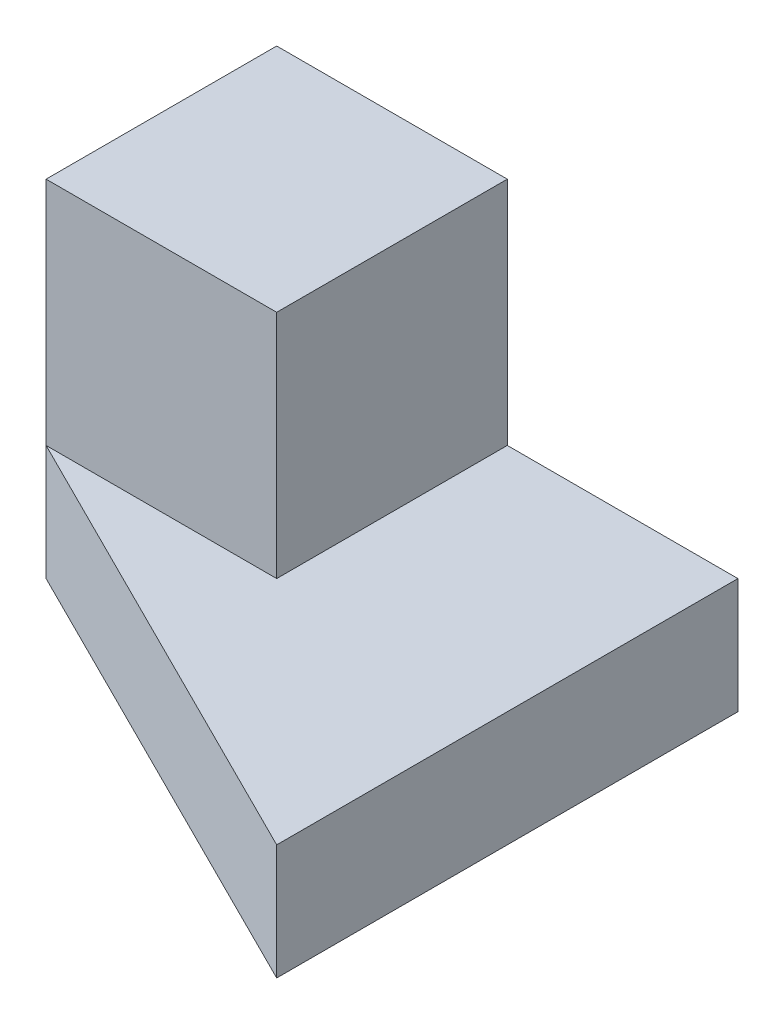
ISO-10303-21;
HEADER;
FILE_DESCRIPTION(('STEP AP214'),'2;1');
FILE_NAME('part.step','',(''),(''),'','','');
FILE_SCHEMA(('AUTOMOTIVE_DESIGN { 1 0 10303 214 1 1 1 1 }'));
ENDSEC;
DATA;
#1=APPLICATION_CONTEXT('core data for automotive mechanical design processes');
#2=APPLICATION_PROTOCOL_DEFINITION('international standard','automotive_design',2000,#1);
#3=PRODUCT_CONTEXT('',#1,'mechanical');
#4=PRODUCT('Part','Part','',(#3));
#5=PRODUCT_RELATED_PRODUCT_CATEGORY('part','',(#4));
#6=PRODUCT_DEFINITION_FORMATION('','',#4);
#7=PRODUCT_DEFINITION_CONTEXT('part definition',#1,'design');
#8=PRODUCT_DEFINITION('design','',#6,#7);
#9=PRODUCT_DEFINITION_SHAPE('','',#8);
#10=(LENGTH_UNIT() NAMED_UNIT(*) SI_UNIT(.MILLI.,.METRE.));
#11=(NAMED_UNIT(*) PLANE_ANGLE_UNIT() SI_UNIT($,.RADIAN.));
#12=(NAMED_UNIT(*) SI_UNIT($,.STERADIAN.) SOLID_ANGLE_UNIT());
#13=UNCERTAINTY_MEASURE_WITH_UNIT(LENGTH_MEASURE(1.E-05),#10,'distance_accuracy_value','');
#14=(GEOMETRIC_REPRESENTATION_CONTEXT(3) GLOBAL_UNCERTAINTY_ASSIGNED_CONTEXT((#13)) GLOBAL_UNIT_ASSIGNED_CONTEXT((#10,
#11,#12)) REPRESENTATION_CONTEXT('',''));
#15=CARTESIAN_POINT('',(0.,0.,0.));
#16=DIRECTION('',(0.,0.,1.));
#17=DIRECTION('',(1.,0.,0.));
#18=AXIS2_PLACEMENT_3D('',#15,#16,#17);
#19=CARTESIAN_POINT('',(0.,3.,0.));
#20=DIRECTION('',(0.,0.,1.));
#21=DIRECTION('',(1.,0.,0.));
#22=AXIS2_PLACEMENT_3D('',#19,#20,#21);
#23=PLANE('',#22);
#24=DIRECTION('',(-1.,0.,0.));
#25=VECTOR('',#24,1.);
#26=CARTESIAN_POINT('',(0.,1.,0.));
#27=LINE('',#26,#25);
#28=CARTESIAN_POINT('',(2.,1.,0.));
#29=VERTEX_POINT('',#28);
#30=CARTESIAN_POINT('',(0.,1.,0.));
#31=VERTEX_POINT('',#30);
#32=EDGE_CURVE('E124',#29,#31,#27,.T.);
#33=ORIENTED_EDGE('',*,*,#32,.F.);
#34=DIRECTION('',(0.,-1.,0.));
#35=VECTOR('',#34,1.);
#36=CARTESIAN_POINT('',(2.,3.,0.));
#37=LINE('',#36,#35);
#38=CARTESIAN_POINT('',(2.,3.,0.));
#39=VERTEX_POINT('',#38);
#40=EDGE_CURVE('E11',#39,#29,#37,.T.);
#41=ORIENTED_EDGE('',*,*,#40,.F.);
#42=DIRECTION('',(-1.,0.,0.));
#43=VECTOR('',#42,1.);
#44=CARTESIAN_POINT('',(0.,3.,0.));
#45=LINE('',#44,#43);
#46=CARTESIAN_POINT('',(0.,3.,0.));
#47=VERTEX_POINT('',#46);
#48=EDGE_CURVE('E105',#39,#47,#45,.T.);
#49=ORIENTED_EDGE('',*,*,#48,.T.);
#50=DIRECTION('',(0.,-1.,0.));
#51=VECTOR('',#50,1.);
#52=CARTESIAN_POINT('',(0.,3.,0.));
#53=LINE('',#52,#51);
#54=EDGE_CURVE('E53',#47,#31,#53,.T.);
#55=ORIENTED_EDGE('',*,*,#54,.T.);
#56=EDGE_LOOP('',(#33,#41,#49,#55));
#57=FACE_BOUND('',#56,.T.);
#58=ADVANCED_FACE('F37',(#57),#23,.T.);
#59=CARTESIAN_POINT('',(2.,3.,0.));
#60=DIRECTION('',(1.,0.,0.));
#61=DIRECTION('',(0.,0.,-1.));
#62=AXIS2_PLACEMENT_3D('',#59,#60,#61);
#63=PLANE('',#62);
#64=DIRECTION('',(0.,0.,1.));
#65=VECTOR('',#64,1.);
#66=CARTESIAN_POINT('',(2.,1.,0.));
#67=LINE('',#66,#65);
#68=CARTESIAN_POINT('',(2.,1.,-2.));
#69=VERTEX_POINT('',#68);
#70=EDGE_CURVE('E96',#69,#29,#67,.T.);
#71=ORIENTED_EDGE('',*,*,#70,.F.);
#72=DIRECTION('',(0.,-1.,0.));
#73=VECTOR('',#72,1.);
#74=CARTESIAN_POINT('',(2.,3.,-2.));
#75=LINE('',#74,#73);
#76=CARTESIAN_POINT('',(2.,3.,-2.));
#77=VERTEX_POINT('',#76);
#78=EDGE_CURVE('E45',#77,#69,#75,.T.);
#79=ORIENTED_EDGE('',*,*,#78,.F.);
#80=DIRECTION('',(0.,0.,1.));
#81=VECTOR('',#80,1.);
#82=CARTESIAN_POINT('',(2.,3.,0.));
#83=LINE('',#82,#81);
#84=EDGE_CURVE('E95',#77,#39,#83,.T.);
#85=ORIENTED_EDGE('',*,*,#84,.T.);
#86=ORIENTED_EDGE('',*,*,#40,.T.);
#87=EDGE_LOOP('',(#71,#79,#85,#86));
#88=FACE_BOUND('',#87,.T.);
#89=ADVANCED_FACE('F94',(#88),#63,.T.);
#90=CARTESIAN_POINT('',(0.,3.,-2.));
#91=DIRECTION('',(0.,0.,-1.));
#92=DIRECTION('',(-1.,0.,0.));
#93=AXIS2_PLACEMENT_3D('',#90,#91,#92);
#94=PLANE('',#93);
#95=DIRECTION('',(1.,0.,0.));
#96=VECTOR('',#95,1.);
#97=CARTESIAN_POINT('',(0.,0.,-2.));
#98=LINE('',#97,#96);
#99=CARTESIAN_POINT('',(0.,0.,-2.));
#100=VERTEX_POINT('',#99);
#101=CARTESIAN_POINT('',(4.,0.,-2.));
#102=VERTEX_POINT('',#101);
#103=EDGE_CURVE('E113',#100,#102,#98,.T.);
#104=ORIENTED_EDGE('',*,*,#103,.F.);
#105=DIRECTION('',(0.,-1.,0.));
#106=VECTOR('',#105,1.);
#107=CARTESIAN_POINT('',(0.,3.,-2.));
#108=LINE('',#107,#106);
#109=CARTESIAN_POINT('',(0.,3.,-2.));
#110=VERTEX_POINT('',#109);
#111=EDGE_CURVE('E63',#110,#100,#108,.T.);
#112=ORIENTED_EDGE('',*,*,#111,.F.);
#113=DIRECTION('',(1.,0.,0.));
#114=VECTOR('',#113,1.);
#115=CARTESIAN_POINT('',(0.,3.,-2.));
#116=LINE('',#115,#114);
#117=EDGE_CURVE('E104',#110,#77,#116,.T.);
#118=ORIENTED_EDGE('',*,*,#117,.T.);
#119=ORIENTED_EDGE('',*,*,#78,.T.);
#120=DIRECTION('',(1.,0.,0.));
#121=VECTOR('',#120,1.);
#122=CARTESIAN_POINT('',(0.,1.,-2.));
#123=LINE('',#122,#121);
#124=CARTESIAN_POINT('',(4.,1.,-2.));
#125=VERTEX_POINT('',#124);
#126=EDGE_CURVE('E74',#69,#125,#123,.T.);
#127=ORIENTED_EDGE('',*,*,#126,.T.);
#128=DIRECTION('',(0.,-1.,0.));
#129=VECTOR('',#128,1.);
#130=CARTESIAN_POINT('',(4.,1.,-2.));
#131=LINE('',#130,#129);
#132=EDGE_CURVE('E144',#125,#102,#131,.T.);
#133=ORIENTED_EDGE('',*,*,#132,.T.);
#134=EDGE_LOOP('',(#104,#112,#118,#119,#127,#133));
#135=FACE_BOUND('',#134,.T.);
#136=ADVANCED_FACE('F107',(#135),#94,.T.);
#137=CARTESIAN_POINT('',(0.,3.,0.));
#138=DIRECTION('',(-1.,0.,0.));
#139=DIRECTION('',(0.,0.,1.));
#140=AXIS2_PLACEMENT_3D('',#137,#138,#139);
#141=PLANE('',#140);
#142=DIRECTION('',(0.,0.,-1.));
#143=VECTOR('',#142,1.);
#144=CARTESIAN_POINT('',(0.,0.,0.));
#145=LINE('',#144,#143);
#146=CARTESIAN_POINT('',(0.,0.,0.));
#147=VERTEX_POINT('',#146);
#148=EDGE_CURVE('E115',#147,#100,#145,.T.);
#149=ORIENTED_EDGE('',*,*,#148,.F.);
#150=DIRECTION('',(0.,-1.,0.));
#151=VECTOR('',#150,1.);
#152=CARTESIAN_POINT('',(0.,1.,0.));
#153=LINE('',#152,#151);
#154=EDGE_CURVE('E116',#31,#147,#153,.T.);
#155=ORIENTED_EDGE('',*,*,#154,.F.);
#156=ORIENTED_EDGE('',*,*,#54,.F.);
#157=DIRECTION('',(0.,0.,-1.));
#158=VECTOR('',#157,1.);
#159=CARTESIAN_POINT('',(0.,3.,0.));
#160=LINE('',#159,#158);
#161=EDGE_CURVE('E108',#47,#110,#160,.T.);
#162=ORIENTED_EDGE('',*,*,#161,.T.);
#163=ORIENTED_EDGE('',*,*,#111,.T.);
#164=EDGE_LOOP('',(#149,#155,#156,#162,#163));
#165=FACE_BOUND('',#164,.T.);
#166=ADVANCED_FACE('F154',(#165),#141,.T.);
#167=CARTESIAN_POINT('',(0.,3.,0.));
#168=DIRECTION('',(0.,1.,0.));
#169=DIRECTION('',(0.,0.,1.));
#170=AXIS2_PLACEMENT_3D('',#167,#168,#169);
#171=PLANE('',#170);
#172=ORIENTED_EDGE('',*,*,#48,.F.);
#173=ORIENTED_EDGE('',*,*,#84,.F.);
#174=ORIENTED_EDGE('',*,*,#117,.F.);
#175=ORIENTED_EDGE('',*,*,#161,.F.);
#176=EDGE_LOOP('',(#172,#173,#174,#175));
#177=FACE_BOUND('',#176,.T.);
#178=ADVANCED_FACE('F102',(#177),#171,.T.);
#179=CARTESIAN_POINT('',(0.,0.,0.));
#180=DIRECTION('',(0.,1.,0.));
#181=DIRECTION('',(0.,0.,1.));
#182=AXIS2_PLACEMENT_3D('',#179,#180,#181);
#183=PLANE('',#182);
#184=ORIENTED_EDGE('',*,*,#103,.T.);
#185=DIRECTION('',(0.,0.,1.));
#186=VECTOR('',#185,1.);
#187=CARTESIAN_POINT('',(4.,0.,0.));
#188=LINE('',#187,#186);
#189=CARTESIAN_POINT('',(4.,0.,2.));
#190=VERTEX_POINT('',#189);
#191=EDGE_CURVE('E131',#102,#190,#188,.T.);
#192=ORIENTED_EDGE('',*,*,#191,.T.);
#193=DIRECTION('',(-0.894427190999916,0.,-0.447213595499958));
#194=VECTOR('',#193,1.);
#195=CARTESIAN_POINT('',(0.,0.,0.));
#196=LINE('',#195,#194);
#197=EDGE_CURVE('E136',#190,#147,#196,.T.);
#198=ORIENTED_EDGE('',*,*,#197,.T.);
#199=ORIENTED_EDGE('',*,*,#148,.T.);
#200=EDGE_LOOP('',(#184,#192,#198,#199));
#201=FACE_BOUND('',#200,.T.);
#202=ADVANCED_FACE('F156',(#201),#183,.F.);
#203=CARTESIAN_POINT('',(0.,1.,0.));
#204=DIRECTION('',(-0.447213595499958,0.,0.894427190999916));
#205=DIRECTION('',(0.894427190999916,0.,0.447213595499958));
#206=AXIS2_PLACEMENT_3D('',#203,#204,#205);
#207=PLANE('',#206);
#208=ORIENTED_EDGE('',*,*,#197,.F.);
#209=DIRECTION('',(0.,-1.,0.));
#210=VECTOR('',#209,1.);
#211=CARTESIAN_POINT('',(4.,1.,2.));
#212=LINE('',#211,#210);
#213=CARTESIAN_POINT('',(4.,1.,2.));
#214=VERTEX_POINT('',#213);
#215=EDGE_CURVE('E148',#214,#190,#212,.T.);
#216=ORIENTED_EDGE('',*,*,#215,.F.);
#217=DIRECTION('',(-0.894427190999916,0.,-0.447213595499958));
#218=VECTOR('',#217,1.);
#219=CARTESIAN_POINT('',(0.,1.,0.));
#220=LINE('',#219,#218);
#221=EDGE_CURVE('E133',#214,#31,#220,.T.);
#222=ORIENTED_EDGE('',*,*,#221,.T.);
#223=ORIENTED_EDGE('',*,*,#154,.T.);
#224=EDGE_LOOP('',(#208,#216,#222,#223));
#225=FACE_BOUND('',#224,.T.);
#226=ADVANCED_FACE('F153',(#225),#207,.T.);
#227=CARTESIAN_POINT('',(4.,1.,0.));
#228=DIRECTION('',(1.,0.,0.));
#229=DIRECTION('',(0.,0.,-1.));
#230=AXIS2_PLACEMENT_3D('',#227,#228,#229);
#231=PLANE('',#230);
#232=ORIENTED_EDGE('',*,*,#191,.F.);
#233=ORIENTED_EDGE('',*,*,#132,.F.);
#234=DIRECTION('',(0.,0.,1.));
#235=VECTOR('',#234,1.);
#236=CARTESIAN_POINT('',(4.,1.,0.));
#237=LINE('',#236,#235);
#238=EDGE_CURVE('E140',#125,#214,#237,.T.);
#239=ORIENTED_EDGE('',*,*,#238,.T.);
#240=ORIENTED_EDGE('',*,*,#215,.T.);
#241=EDGE_LOOP('',(#232,#233,#239,#240));
#242=FACE_BOUND('',#241,.T.);
#243=ADVANCED_FACE('F159',(#242),#231,.T.);
#244=CARTESIAN_POINT('',(0.,1.,0.));
#245=DIRECTION('',(0.,1.,0.));
#246=DIRECTION('',(0.,0.,1.));
#247=AXIS2_PLACEMENT_3D('',#244,#245,#246);
#248=PLANE('',#247);
#249=ORIENTED_EDGE('',*,*,#70,.T.);
#250=ORIENTED_EDGE('',*,*,#32,.T.);
#251=ORIENTED_EDGE('',*,*,#221,.F.);
#252=ORIENTED_EDGE('',*,*,#238,.F.);
#253=ORIENTED_EDGE('',*,*,#126,.F.);
#254=EDGE_LOOP('',(#249,#250,#251,#252,#253));
#255=FACE_BOUND('',#254,.T.);
#256=ADVANCED_FACE('F130',(#255),#248,.T.);
#257=CLOSED_SHELL('',(#58,#89,#136,#166,#178,#202,#226,#243,#256));
#258=MANIFOLD_SOLID_BREP('B2',#257);
#259=ADVANCED_BREP_SHAPE_REPRESENTATION('',(#18,#258),#14);
#260=SHAPE_DEFINITION_REPRESENTATION(#9,#259);
ENDSEC;
END-ISO-10303-21;
